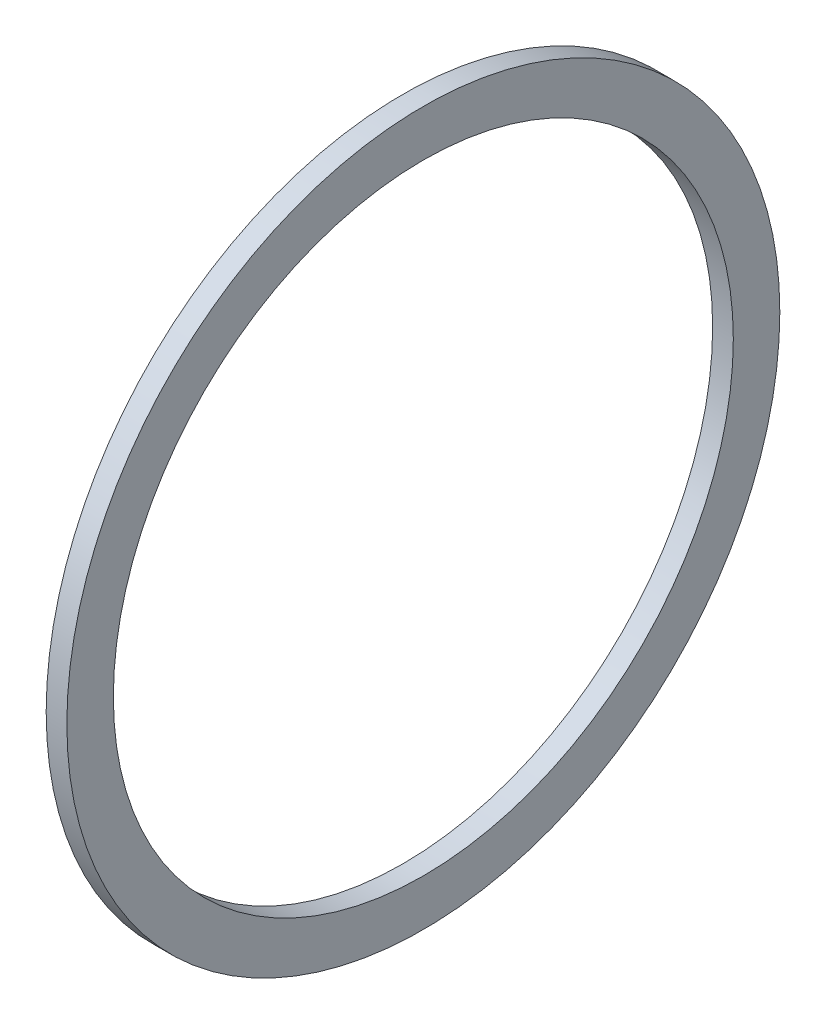
ISO-10303-21;
HEADER;
FILE_DESCRIPTION(('STEP AP214'),'2;1');
FILE_NAME('part.step','',(''),(''),'','','');
FILE_SCHEMA(('AUTOMOTIVE_DESIGN { 1 0 10303 214 1 1 1 1 }'));
ENDSEC;
DATA;
#1=APPLICATION_CONTEXT('core data for automotive mechanical design processes');
#2=APPLICATION_PROTOCOL_DEFINITION('international standard','automotive_design',2000,#1);
#3=PRODUCT_CONTEXT('',#1,'mechanical');
#4=PRODUCT('Part','Part','',(#3));
#5=PRODUCT_RELATED_PRODUCT_CATEGORY('part','',(#4));
#6=PRODUCT_DEFINITION_FORMATION('','',#4);
#7=PRODUCT_DEFINITION_CONTEXT('part definition',#1,'design');
#8=PRODUCT_DEFINITION('design','',#6,#7);
#9=PRODUCT_DEFINITION_SHAPE('','',#8);
#10=(LENGTH_UNIT() NAMED_UNIT(*) SI_UNIT(.MILLI.,.METRE.));
#11=(NAMED_UNIT(*) PLANE_ANGLE_UNIT() SI_UNIT($,.RADIAN.));
#12=(NAMED_UNIT(*) SI_UNIT($,.STERADIAN.) SOLID_ANGLE_UNIT());
#13=UNCERTAINTY_MEASURE_WITH_UNIT(LENGTH_MEASURE(1.E-05),#10,'distance_accuracy_value','');
#14=(GEOMETRIC_REPRESENTATION_CONTEXT(3) GLOBAL_UNCERTAINTY_ASSIGNED_CONTEXT((#13)) GLOBAL_UNIT_ASSIGNED_CONTEXT((#10,
#11,#12)) REPRESENTATION_CONTEXT('',''));
#15=CARTESIAN_POINT('',(0.,0.,0.));
#16=DIRECTION('',(0.,0.,1.));
#17=DIRECTION('',(1.,0.,0.));
#18=AXIS2_PLACEMENT_3D('',#15,#16,#17);
#19=CARTESIAN_POINT('',(2.,0.,0.));
#20=DIRECTION('',(1.,0.,0.));
#21=DIRECTION('',(0.,0.,-1.));
#22=AXIS2_PLACEMENT_3D('',#19,#20,#21);
#23=PLANE('',#22);
#24=CARTESIAN_POINT('',(2.,0.,0.));
#25=DIRECTION('',(1.,0.,0.));
#26=DIRECTION('',(0.,0.,-1.));
#27=AXIS2_PLACEMENT_3D('',#24,#25,#26);
#28=CIRCLE('',#27,34.5);
#29=CARTESIAN_POINT('',(2.,0.,-34.5));
#30=VERTEX_POINT('',#29);
#31=EDGE_CURVE('E10',#30,#30,#28,.T.);
#32=ORIENTED_EDGE('',*,*,#31,.T.);
#33=EDGE_LOOP('',(#32));
#34=FACE_BOUND('',#33,.T.);
#35=CARTESIAN_POINT('',(2.,0.,0.));
#36=DIRECTION('',(1.,0.,0.));
#37=DIRECTION('',(0.,0.,-1.));
#38=AXIS2_PLACEMENT_3D('',#35,#36,#37);
#39=CIRCLE('',#38,30.);
#40=CARTESIAN_POINT('',(2.,0.,-30.));
#41=VERTEX_POINT('',#40);
#42=EDGE_CURVE('E47',#41,#41,#39,.T.);
#43=ORIENTED_EDGE('',*,*,#42,.F.);
#44=EDGE_LOOP('',(#43));
#45=FACE_BOUND('',#44,.T.);
#46=ADVANCED_FACE('F36',(#34,#45),#23,.T.);
#47=CARTESIAN_POINT('',(0.,0.,0.));
#48=DIRECTION('',(1.,0.,0.));
#49=DIRECTION('',(0.,0.,-1.));
#50=AXIS2_PLACEMENT_3D('',#47,#48,#49);
#51=PLANE('',#50);
#52=CARTESIAN_POINT('',(0.,0.,0.));
#53=DIRECTION('',(1.,0.,0.));
#54=DIRECTION('',(0.,0.,-1.));
#55=AXIS2_PLACEMENT_3D('',#52,#53,#54);
#56=CIRCLE('',#55,34.5);
#57=CARTESIAN_POINT('',(0.,0.,-34.5));
#58=VERTEX_POINT('',#57);
#59=EDGE_CURVE('E40',#58,#58,#56,.T.);
#60=ORIENTED_EDGE('',*,*,#59,.F.);
#61=EDGE_LOOP('',(#60));
#62=FACE_BOUND('',#61,.T.);
#63=CARTESIAN_POINT('',(0.,0.,0.));
#64=DIRECTION('',(1.,0.,0.));
#65=DIRECTION('',(0.,0.,-1.));
#66=AXIS2_PLACEMENT_3D('',#63,#64,#65);
#67=CIRCLE('',#66,30.);
#68=CARTESIAN_POINT('',(0.,0.,-30.));
#69=VERTEX_POINT('',#68);
#70=EDGE_CURVE('E49',#69,#69,#67,.T.);
#71=ORIENTED_EDGE('',*,*,#70,.T.);
#72=EDGE_LOOP('',(#71));
#73=FACE_BOUND('',#72,.T.);
#74=ADVANCED_FACE('F59',(#62,#73),#51,.F.);
#75=CARTESIAN_POINT('',(2.,0.,0.));
#76=DIRECTION('',(-1.,0.,0.));
#77=DIRECTION('',(0.,0.,1.));
#78=AXIS2_PLACEMENT_3D('',#75,#76,#77);
#79=CYLINDRICAL_SURFACE('',#78,34.5);
#80=ORIENTED_EDGE('',*,*,#31,.F.);
#81=EDGE_LOOP('',(#80));
#82=FACE_BOUND('',#81,.T.);
#83=ORIENTED_EDGE('',*,*,#59,.T.);
#84=EDGE_LOOP('',(#83));
#85=FACE_BOUND('',#84,.T.);
#86=ADVANCED_FACE('F38',(#82,#85),#79,.T.);
#87=CARTESIAN_POINT('',(2.,0.,0.));
#88=DIRECTION('',(-1.,0.,0.));
#89=DIRECTION('',(0.,0.,1.));
#90=AXIS2_PLACEMENT_3D('',#87,#88,#89);
#91=CYLINDRICAL_SURFACE('',#90,30.);
#92=ORIENTED_EDGE('',*,*,#42,.T.);
#93=EDGE_LOOP('',(#92));
#94=FACE_BOUND('',#93,.T.);
#95=ORIENTED_EDGE('',*,*,#70,.F.);
#96=EDGE_LOOP('',(#95));
#97=FACE_BOUND('',#96,.T.);
#98=ADVANCED_FACE('F55',(#94,#97),#91,.F.);
#99=CLOSED_SHELL('',(#46,#74,#86,#98));
#100=MANIFOLD_SOLID_BREP('B2',#99);
#101=ADVANCED_BREP_SHAPE_REPRESENTATION('',(#18,#100),#14);
#102=SHAPE_DEFINITION_REPRESENTATION(#9,#101);
ENDSEC;
END-ISO-10303-21;
